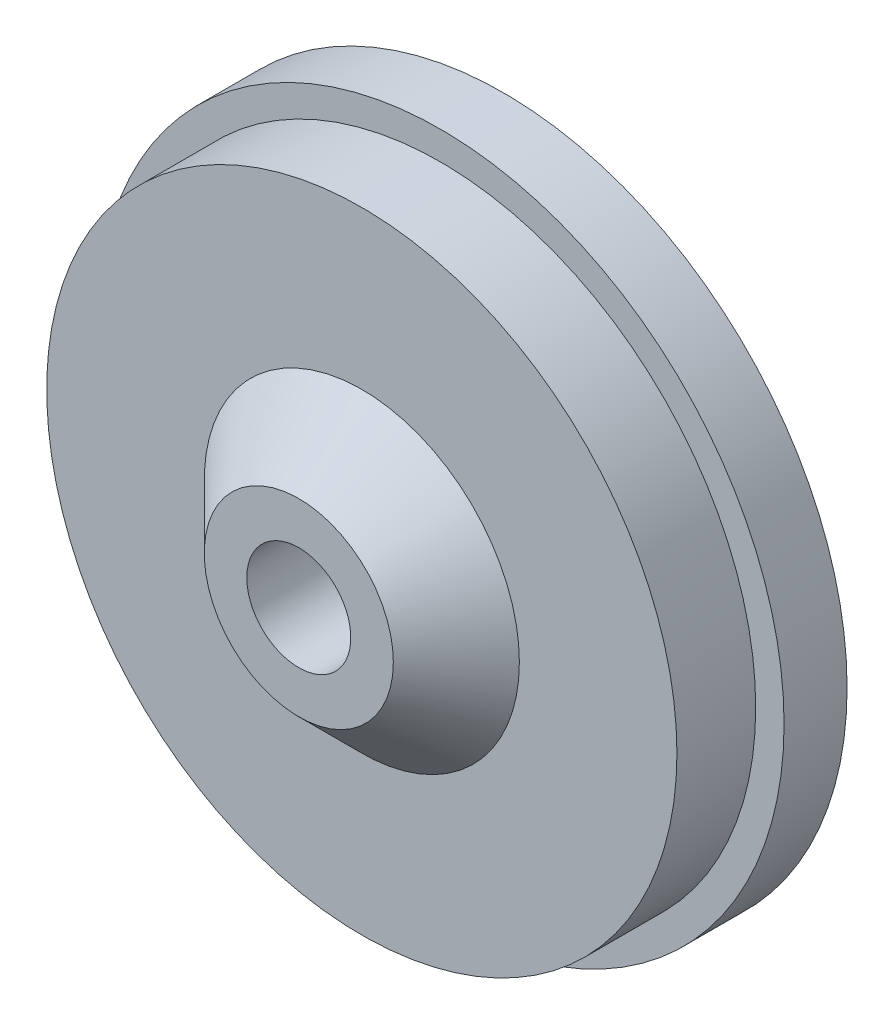
ISO-10303-21;
HEADER;
FILE_DESCRIPTION(('STEP AP214'),'2;1');
FILE_NAME('part.step','',(''),(''),'','','');
FILE_SCHEMA(('AUTOMOTIVE_DESIGN { 1 0 10303 214 1 1 1 1 }'));
ENDSEC;
DATA;
#1=APPLICATION_CONTEXT('core data for automotive mechanical design processes');
#2=APPLICATION_PROTOCOL_DEFINITION('international standard','automotive_design',2000,#1);
#3=PRODUCT_CONTEXT('',#1,'mechanical');
#4=PRODUCT('Part','Part','',(#3));
#5=PRODUCT_RELATED_PRODUCT_CATEGORY('part','',(#4));
#6=PRODUCT_DEFINITION_FORMATION('','',#4);
#7=PRODUCT_DEFINITION_CONTEXT('part definition',#1,'design');
#8=PRODUCT_DEFINITION('design','',#6,#7);
#9=PRODUCT_DEFINITION_SHAPE('','',#8);
#10=(LENGTH_UNIT() NAMED_UNIT(*) SI_UNIT(.MILLI.,.METRE.));
#11=(NAMED_UNIT(*) PLANE_ANGLE_UNIT() SI_UNIT($,.RADIAN.));
#12=(NAMED_UNIT(*) SI_UNIT($,.STERADIAN.) SOLID_ANGLE_UNIT());
#13=UNCERTAINTY_MEASURE_WITH_UNIT(LENGTH_MEASURE(1.E-05),#10,'distance_accuracy_value','');
#14=(GEOMETRIC_REPRESENTATION_CONTEXT(3) GLOBAL_UNCERTAINTY_ASSIGNED_CONTEXT((#13)) GLOBAL_UNIT_ASSIGNED_CONTEXT((#10,
#11,#12)) REPRESENTATION_CONTEXT('',''));
#15=CARTESIAN_POINT('',(0.,0.,0.));
#16=DIRECTION('',(0.,0.,1.));
#17=DIRECTION('',(1.,0.,0.));
#18=AXIS2_PLACEMENT_3D('',#15,#16,#17);
#19=CARTESIAN_POINT('',(0.,0.,4.5));
#20=DIRECTION('',(0.,0.,1.));
#21=DIRECTION('',(1.,0.,0.));
#22=AXIS2_PLACEMENT_3D('',#19,#20,#21);
#23=PLANE('',#22);
#24=CARTESIAN_POINT('',(0.,0.,4.5));
#25=DIRECTION('',(0.,0.,1.));
#26=DIRECTION('',(1.,0.,0.));
#27=AXIS2_PLACEMENT_3D('',#24,#25,#26);
#28=CIRCLE('',#27,5.);
#29=CARTESIAN_POINT('',(5.,0.,4.5));
#30=VERTEX_POINT('',#29);
#31=EDGE_CURVE('E10',#30,#30,#28,.F.);
#32=ORIENTED_EDGE('',*,*,#31,.T.);
#33=EDGE_LOOP('',(#32));
#34=FACE_BOUND('',#33,.T.);
#35=CARTESIAN_POINT('',(0.,0.,4.5));
#36=DIRECTION('',(0.,0.,1.));
#37=DIRECTION('',(1.,0.,0.));
#38=AXIS2_PLACEMENT_3D('',#35,#36,#37);
#39=CIRCLE('',#38,10.);
#40=CARTESIAN_POINT('',(10.,0.,4.5));
#41=VERTEX_POINT('',#40);
#42=EDGE_CURVE('E44',#41,#41,#39,.T.);
#43=ORIENTED_EDGE('',*,*,#42,.T.);
#44=EDGE_LOOP('',(#43));
#45=FACE_BOUND('',#44,.T.);
#46=ADVANCED_FACE('F28',(#34,#45),#23,.T.);
#47=CARTESIAN_POINT('',(0.,0.,2.));
#48=DIRECTION('',(0.,0.,1.));
#49=DIRECTION('',(1.,0.,0.));
#50=AXIS2_PLACEMENT_3D('',#47,#48,#49);
#51=PLANE('',#50);
#52=CARTESIAN_POINT('',(0.,0.,2.));
#53=DIRECTION('',(0.,0.,1.));
#54=DIRECTION('',(1.,0.,0.));
#55=AXIS2_PLACEMENT_3D('',#52,#53,#54);
#56=CIRCLE('',#55,10.9);
#57=CARTESIAN_POINT('',(10.9,0.,2.));
#58=VERTEX_POINT('',#57);
#59=EDGE_CURVE('E35',#58,#58,#56,.T.);
#60=ORIENTED_EDGE('',*,*,#59,.T.);
#61=EDGE_LOOP('',(#60));
#62=FACE_BOUND('',#61,.T.);
#63=CARTESIAN_POINT('',(0.,0.,2.));
#64=DIRECTION('',(0.,0.,1.));
#65=DIRECTION('',(1.,0.,0.));
#66=AXIS2_PLACEMENT_3D('',#63,#64,#65);
#67=CIRCLE('',#66,10.);
#68=CARTESIAN_POINT('',(10.,0.,2.));
#69=VERTEX_POINT('',#68);
#70=EDGE_CURVE('E46',#69,#69,#67,.T.);
#71=ORIENTED_EDGE('',*,*,#70,.F.);
#72=EDGE_LOOP('',(#71));
#73=FACE_BOUND('',#72,.T.);
#74=ADVANCED_FACE('F79',(#62,#73),#51,.T.);
#75=CARTESIAN_POINT('',(0.,0.,2.));
#76=DIRECTION('',(0.,0.,-1.));
#77=DIRECTION('',(-1.,0.,0.));
#78=AXIS2_PLACEMENT_3D('',#75,#76,#77);
#79=CYLINDRICAL_SURFACE('',#78,10.9);
#80=ORIENTED_EDGE('',*,*,#59,.F.);
#81=EDGE_LOOP('',(#80));
#82=FACE_BOUND('',#81,.T.);
#83=CARTESIAN_POINT('',(0.,0.,0.));
#84=DIRECTION('',(0.,0.,1.));
#85=DIRECTION('',(1.,0.,0.));
#86=AXIS2_PLACEMENT_3D('',#83,#84,#85);
#87=CIRCLE('',#86,10.9);
#88=CARTESIAN_POINT('',(10.9,0.,0.));
#89=VERTEX_POINT('',#88);
#90=EDGE_CURVE('E39',#89,#89,#87,.T.);
#91=ORIENTED_EDGE('',*,*,#90,.T.);
#92=EDGE_LOOP('',(#91));
#93=FACE_BOUND('',#92,.T.);
#94=ADVANCED_FACE('F74',(#82,#93),#79,.T.);
#95=CARTESIAN_POINT('',(0.,0.,0.));
#96=DIRECTION('',(0.,0.,1.));
#97=DIRECTION('',(1.,0.,0.));
#98=AXIS2_PLACEMENT_3D('',#95,#96,#97);
#99=PLANE('',#98);
#100=CARTESIAN_POINT('',(0.,0.,0.));
#101=DIRECTION('',(0.,0.,-1.));
#102=DIRECTION('',(-1.,0.,0.));
#103=AXIS2_PLACEMENT_3D('',#100,#101,#102);
#104=CIRCLE('',#103,1.65);
#105=CARTESIAN_POINT('',(-1.65,0.,0.));
#106=VERTEX_POINT('',#105);
#107=EDGE_CURVE('E55',#106,#106,#104,.T.);
#108=ORIENTED_EDGE('',*,*,#107,.F.);
#109=EDGE_LOOP('',(#108));
#110=FACE_BOUND('',#109,.T.);
#111=ORIENTED_EDGE('',*,*,#90,.F.);
#112=EDGE_LOOP('',(#111));
#113=FACE_BOUND('',#112,.T.);
#114=ADVANCED_FACE('F70',(#110,#113),#99,.F.);
#115=CARTESIAN_POINT('',(0.,0.,4.5));
#116=DIRECTION('',(0.,0.,-1.));
#117=DIRECTION('',(-1.,0.,0.));
#118=AXIS2_PLACEMENT_3D('',#115,#116,#117);
#119=CYLINDRICAL_SURFACE('',#118,10.);
#120=ORIENTED_EDGE('',*,*,#42,.F.);
#121=EDGE_LOOP('',(#120));
#122=FACE_BOUND('',#121,.T.);
#123=ORIENTED_EDGE('',*,*,#70,.T.);
#124=EDGE_LOOP('',(#123));
#125=FACE_BOUND('',#124,.T.);
#126=ADVANCED_FACE('F73',(#122,#125),#119,.T.);
#127=CARTESIAN_POINT('',(0.,0.,6.5));
#128=DIRECTION('',(0.,0.,1.));
#129=DIRECTION('',(1.,0.,0.));
#130=AXIS2_PLACEMENT_3D('',#127,#128,#129);
#131=PLANE('',#130);
#132=CARTESIAN_POINT('',(0.,0.,6.5));
#133=DIRECTION('',(0.,0.,-1.));
#134=DIRECTION('',(-1.,0.,0.));
#135=AXIS2_PLACEMENT_3D('',#132,#133,#134);
#136=CIRCLE('',#135,1.65);
#137=CARTESIAN_POINT('',(-1.65,0.,6.5));
#138=VERTEX_POINT('',#137);
#139=EDGE_CURVE('E54',#138,#138,#136,.T.);
#140=ORIENTED_EDGE('',*,*,#139,.T.);
#141=EDGE_LOOP('',(#140));
#142=FACE_BOUND('',#141,.T.);
#143=CARTESIAN_POINT('',(0.,0.,6.5));
#144=DIRECTION('',(0.,0.,1.));
#145=DIRECTION('',(1.,0.,0.));
#146=AXIS2_PLACEMENT_3D('',#143,#144,#145);
#147=CIRCLE('',#146,3.);
#148=CARTESIAN_POINT('',(3.,0.,6.5));
#149=VERTEX_POINT('',#148);
#150=EDGE_CURVE('E49',#149,#149,#147,.T.);
#151=ORIENTED_EDGE('',*,*,#150,.T.);
#152=EDGE_LOOP('',(#151));
#153=FACE_BOUND('',#152,.T.);
#154=ADVANCED_FACE('F61',(#142,#153),#131,.T.);
#155=CARTESIAN_POINT('',(0.,0.,6.5));
#156=DIRECTION('',(0.,0.,-1.));
#157=DIRECTION('',(-1.,0.,0.));
#158=AXIS2_PLACEMENT_3D('',#155,#156,#157);
#159=CYLINDRICAL_SURFACE('',#158,1.65);
#160=ORIENTED_EDGE('',*,*,#139,.F.);
#161=EDGE_LOOP('',(#160));
#162=FACE_BOUND('',#161,.T.);
#163=ORIENTED_EDGE('',*,*,#107,.T.);
#164=EDGE_LOOP('',(#163));
#165=FACE_BOUND('',#164,.T.);
#166=ADVANCED_FACE('F64',(#162,#165),#159,.F.);
#167=CARTESIAN_POINT('',(0.,0.,6.50000000000002));
#168=DIRECTION('',(0.,0.,-1.));
#169=DIRECTION('',(-1.,0.,0.));
#170=AXIS2_PLACEMENT_3D('',#167,#168,#169);
#171=CONICAL_SURFACE('',#170,3.,0.785398163397443);
#172=ORIENTED_EDGE('',*,*,#31,.F.);
#173=EDGE_LOOP('',(#172));
#174=FACE_BOUND('',#173,.T.);
#175=ORIENTED_EDGE('',*,*,#150,.F.);
#176=EDGE_LOOP('',(#175));
#177=FACE_BOUND('',#176,.T.);
#178=ADVANCED_FACE('F30',(#174,#177),#171,.T.);
#179=CLOSED_SHELL('',(#46,#74,#94,#114,#126,#154,#166,#178));
#180=MANIFOLD_SOLID_BREP('B2',#179);
#181=ADVANCED_BREP_SHAPE_REPRESENTATION('',(#18,#180),#14);
#182=SHAPE_DEFINITION_REPRESENTATION(#9,#181);
ENDSEC;
END-ISO-10303-21;
